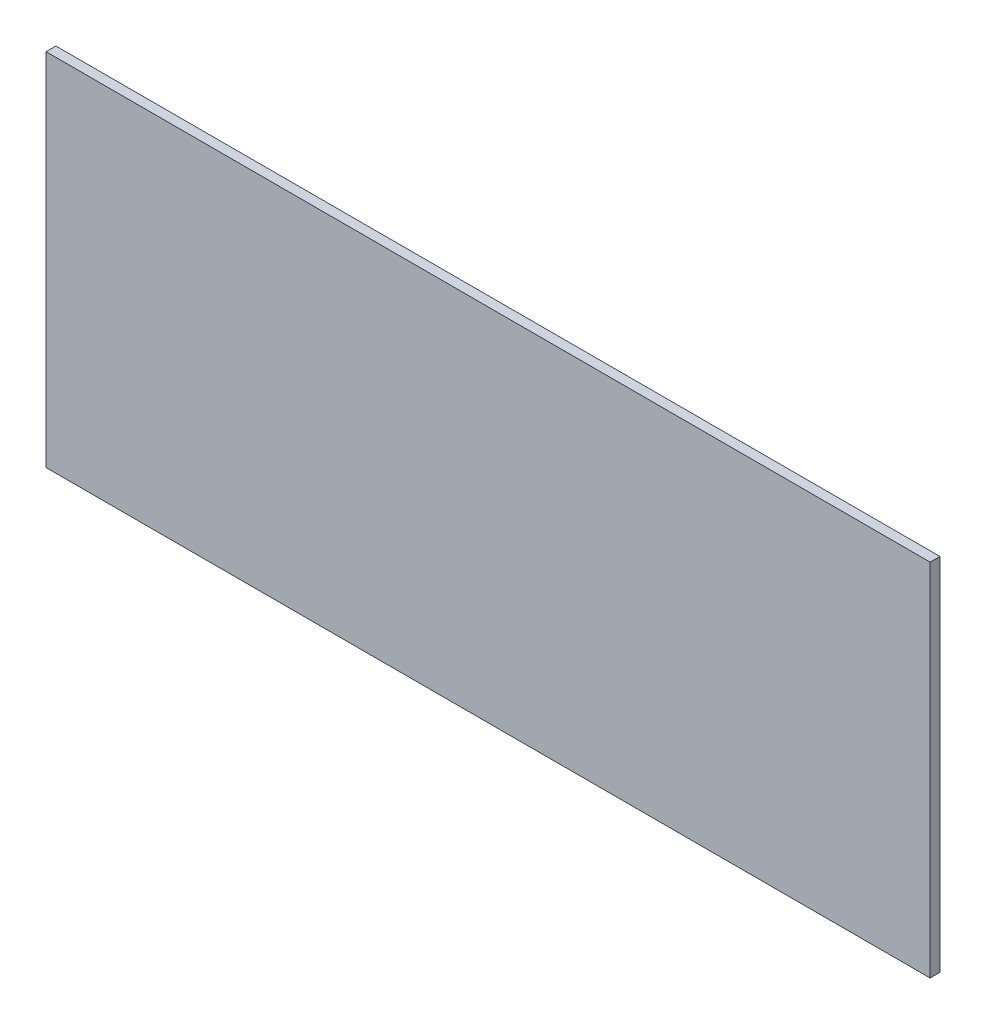
ISO-10303-21;
HEADER;
FILE_DESCRIPTION(('STEP AP214'),'2;1');
FILE_NAME('part.step','',(''),(''),'','','');
FILE_SCHEMA(('AUTOMOTIVE_DESIGN { 1 0 10303 214 1 1 1 1 }'));
ENDSEC;
DATA;
#1=APPLICATION_CONTEXT('core data for automotive mechanical design processes');
#2=APPLICATION_PROTOCOL_DEFINITION('international standard','automotive_design',2000,#1);
#3=PRODUCT_CONTEXT('',#1,'mechanical');
#4=PRODUCT('Part','Part','',(#3));
#5=PRODUCT_RELATED_PRODUCT_CATEGORY('part','',(#4));
#6=PRODUCT_DEFINITION_FORMATION('','',#4);
#7=PRODUCT_DEFINITION_CONTEXT('part definition',#1,'design');
#8=PRODUCT_DEFINITION('design','',#6,#7);
#9=PRODUCT_DEFINITION_SHAPE('','',#8);
#10=(LENGTH_UNIT() NAMED_UNIT(*) SI_UNIT(.MILLI.,.METRE.));
#11=(NAMED_UNIT(*) PLANE_ANGLE_UNIT() SI_UNIT($,.RADIAN.));
#12=(NAMED_UNIT(*) SI_UNIT($,.STERADIAN.) SOLID_ANGLE_UNIT());
#13=UNCERTAINTY_MEASURE_WITH_UNIT(LENGTH_MEASURE(1.E-05),#10,'distance_accuracy_value','');
#14=(GEOMETRIC_REPRESENTATION_CONTEXT(3) GLOBAL_UNCERTAINTY_ASSIGNED_CONTEXT((#13)) GLOBAL_UNIT_ASSIGNED_CONTEXT((#10,
#11,#12)) REPRESENTATION_CONTEXT('',''));
#15=CARTESIAN_POINT('',(0.,0.,0.));
#16=DIRECTION('',(0.,0.,1.));
#17=DIRECTION('',(1.,0.,0.));
#18=AXIS2_PLACEMENT_3D('',#15,#16,#17);
#19=CARTESIAN_POINT('',(-270.,-110.,6.));
#20=DIRECTION('',(1.,0.,0.));
#21=DIRECTION('',(0.,0.,-1.));
#22=AXIS2_PLACEMENT_3D('',#19,#20,#21);
#23=PLANE('',#22);
#24=DIRECTION('',(0.,-1.,0.));
#25=VECTOR('',#24,1.);
#26=CARTESIAN_POINT('',(-270.,-110.,0.));
#27=LINE('',#26,#25);
#28=CARTESIAN_POINT('',(-270.,110.,0.));
#29=VERTEX_POINT('',#28);
#30=CARTESIAN_POINT('',(-270.,-110.,0.));
#31=VERTEX_POINT('',#30);
#32=EDGE_CURVE('E96',#29,#31,#27,.T.);
#33=ORIENTED_EDGE('',*,*,#32,.T.);
#34=DIRECTION('',(0.,0.,-1.));
#35=VECTOR('',#34,1.);
#36=CARTESIAN_POINT('',(-270.,-110.,6.));
#37=LINE('',#36,#35);
#38=CARTESIAN_POINT('',(-270.,-110.,6.));
#39=VERTEX_POINT('',#38);
#40=EDGE_CURVE('E11',#39,#31,#37,.T.);
#41=ORIENTED_EDGE('',*,*,#40,.F.);
#42=DIRECTION('',(0.,-1.,0.));
#43=VECTOR('',#42,1.);
#44=CARTESIAN_POINT('',(-270.,-110.,6.));
#45=LINE('',#44,#43);
#46=CARTESIAN_POINT('',(-270.,110.,6.));
#47=VERTEX_POINT('',#46);
#48=EDGE_CURVE('E84',#47,#39,#45,.T.);
#49=ORIENTED_EDGE('',*,*,#48,.F.);
#50=DIRECTION('',(0.,0.,-1.));
#51=VECTOR('',#50,1.);
#52=CARTESIAN_POINT('',(-270.,110.,6.));
#53=LINE('',#52,#51);
#54=EDGE_CURVE('E92',#47,#29,#53,.T.);
#55=ORIENTED_EDGE('',*,*,#54,.T.);
#56=EDGE_LOOP('',(#33,#41,#49,#55));
#57=FACE_BOUND('',#56,.T.);
#58=ADVANCED_FACE('F33',(#57),#23,.F.);
#59=CARTESIAN_POINT('',(270.,-110.,6.));
#60=DIRECTION('',(0.,1.,0.));
#61=DIRECTION('',(-1.,0.,0.));
#62=AXIS2_PLACEMENT_3D('',#59,#60,#61);
#63=PLANE('',#62);
#64=DIRECTION('',(1.,0.,0.));
#65=VECTOR('',#64,1.);
#66=CARTESIAN_POINT('',(270.,-110.,0.));
#67=LINE('',#66,#65);
#68=CARTESIAN_POINT('',(270.,-110.,0.));
#69=VERTEX_POINT('',#68);
#70=EDGE_CURVE('E88',#31,#69,#67,.T.);
#71=ORIENTED_EDGE('',*,*,#70,.T.);
#72=DIRECTION('',(0.,0.,-1.));
#73=VECTOR('',#72,1.);
#74=CARTESIAN_POINT('',(270.,-110.,6.));
#75=LINE('',#74,#73);
#76=CARTESIAN_POINT('',(270.,-110.,6.));
#77=VERTEX_POINT('',#76);
#78=EDGE_CURVE('E41',#77,#69,#75,.T.);
#79=ORIENTED_EDGE('',*,*,#78,.F.);
#80=DIRECTION('',(1.,0.,0.));
#81=VECTOR('',#80,1.);
#82=CARTESIAN_POINT('',(270.,-110.,6.));
#83=LINE('',#82,#81);
#84=EDGE_CURVE('E79',#39,#77,#83,.T.);
#85=ORIENTED_EDGE('',*,*,#84,.F.);
#86=ORIENTED_EDGE('',*,*,#40,.T.);
#87=EDGE_LOOP('',(#71,#79,#85,#86));
#88=FACE_BOUND('',#87,.T.);
#89=ADVANCED_FACE('F87',(#88),#63,.F.);
#90=CARTESIAN_POINT('',(270.,-110.,6.));
#91=DIRECTION('',(-1.,0.,0.));
#92=DIRECTION('',(0.,0.,1.));
#93=AXIS2_PLACEMENT_3D('',#90,#91,#92);
#94=PLANE('',#93);
#95=DIRECTION('',(0.,1.,0.));
#96=VECTOR('',#95,1.);
#97=CARTESIAN_POINT('',(270.,-110.,0.));
#98=LINE('',#97,#96);
#99=CARTESIAN_POINT('',(270.,110.,0.));
#100=VERTEX_POINT('',#99);
#101=EDGE_CURVE('E66',#69,#100,#98,.T.);
#102=ORIENTED_EDGE('',*,*,#101,.T.);
#103=DIRECTION('',(0.,0.,-1.));
#104=VECTOR('',#103,1.);
#105=CARTESIAN_POINT('',(270.,110.,6.));
#106=LINE('',#105,#104);
#107=CARTESIAN_POINT('',(270.,110.,6.));
#108=VERTEX_POINT('',#107);
#109=EDGE_CURVE('E89',#108,#100,#106,.T.);
#110=ORIENTED_EDGE('',*,*,#109,.F.);
#111=DIRECTION('',(0.,1.,0.));
#112=VECTOR('',#111,1.);
#113=CARTESIAN_POINT('',(270.,-110.,6.));
#114=LINE('',#113,#112);
#115=EDGE_CURVE('E82',#77,#108,#114,.T.);
#116=ORIENTED_EDGE('',*,*,#115,.F.);
#117=ORIENTED_EDGE('',*,*,#78,.T.);
#118=EDGE_LOOP('',(#102,#110,#116,#117));
#119=FACE_BOUND('',#118,.T.);
#120=ADVANCED_FACE('F90',(#119),#94,.F.);
#121=CARTESIAN_POINT('',(270.,110.,6.));
#122=DIRECTION('',(0.,-1.,0.));
#123=DIRECTION('',(1.,0.,0.));
#124=AXIS2_PLACEMENT_3D('',#121,#122,#123);
#125=PLANE('',#124);
#126=DIRECTION('',(-1.,0.,0.));
#127=VECTOR('',#126,1.);
#128=CARTESIAN_POINT('',(270.,110.,0.));
#129=LINE('',#128,#127);
#130=EDGE_CURVE('E72',#100,#29,#129,.T.);
#131=ORIENTED_EDGE('',*,*,#130,.T.);
#132=ORIENTED_EDGE('',*,*,#54,.F.);
#133=DIRECTION('',(-1.,0.,0.));
#134=VECTOR('',#133,1.);
#135=CARTESIAN_POINT('',(270.,110.,6.));
#136=LINE('',#135,#134);
#137=EDGE_CURVE('E49',#108,#47,#136,.T.);
#138=ORIENTED_EDGE('',*,*,#137,.F.);
#139=ORIENTED_EDGE('',*,*,#109,.T.);
#140=EDGE_LOOP('',(#131,#132,#138,#139));
#141=FACE_BOUND('',#140,.T.);
#142=ADVANCED_FACE('F103',(#141),#125,.F.);
#143=CARTESIAN_POINT('',(0.,0.,6.));
#144=DIRECTION('',(0.,0.,1.));
#145=DIRECTION('',(1.,0.,0.));
#146=AXIS2_PLACEMENT_3D('',#143,#144,#145);
#147=PLANE('',#146);
#148=ORIENTED_EDGE('',*,*,#48,.T.);
#149=ORIENTED_EDGE('',*,*,#84,.T.);
#150=ORIENTED_EDGE('',*,*,#115,.T.);
#151=ORIENTED_EDGE('',*,*,#137,.T.);
#152=EDGE_LOOP('',(#148,#149,#150,#151));
#153=FACE_BOUND('',#152,.T.);
#154=ADVANCED_FACE('F80',(#153),#147,.T.);
#155=CARTESIAN_POINT('',(0.,0.,0.));
#156=DIRECTION('',(0.,0.,1.));
#157=DIRECTION('',(1.,0.,0.));
#158=AXIS2_PLACEMENT_3D('',#155,#156,#157);
#159=PLANE('',#158);
#160=ORIENTED_EDGE('',*,*,#32,.F.);
#161=ORIENTED_EDGE('',*,*,#130,.F.);
#162=ORIENTED_EDGE('',*,*,#101,.F.);
#163=ORIENTED_EDGE('',*,*,#70,.F.);
#164=EDGE_LOOP('',(#160,#161,#162,#163));
#165=FACE_BOUND('',#164,.T.);
#166=ADVANCED_FACE('F106',(#165),#159,.F.);
#167=CLOSED_SHELL('',(#58,#89,#120,#142,#154,#166));
#168=MANIFOLD_SOLID_BREP('B2',#167);
#169=ADVANCED_BREP_SHAPE_REPRESENTATION('',(#18,#168),#14);
#170=SHAPE_DEFINITION_REPRESENTATION(#9,#169);
ENDSEC;
END-ISO-10303-21;
